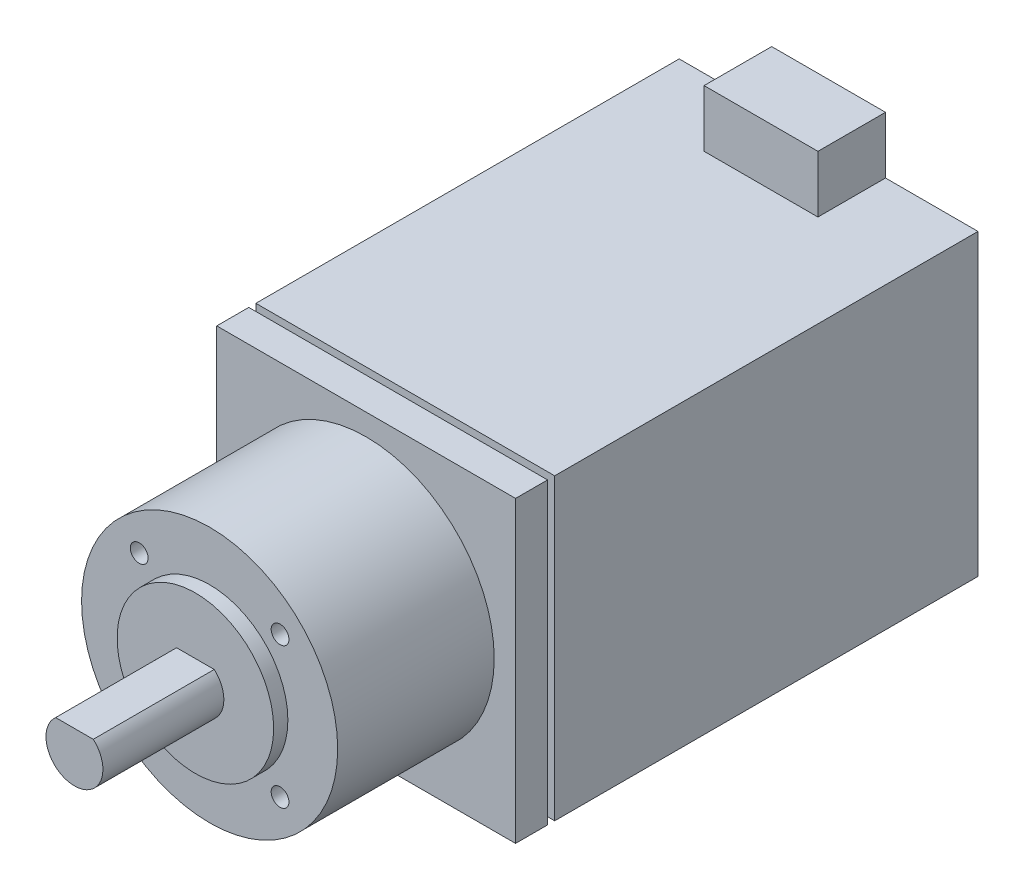
ISO-10303-21;
HEADER;
FILE_DESCRIPTION(('STEP AP214'),'2;1');
FILE_NAME('part.step','',(''),(''),'','','');
FILE_SCHEMA(('AUTOMOTIVE_DESIGN { 1 0 10303 214 1 1 1 1 }'));
ENDSEC;
DATA;
#1=APPLICATION_CONTEXT('core data for automotive mechanical design processes');
#2=APPLICATION_PROTOCOL_DEFINITION('international standard','automotive_design',2000,#1);
#3=PRODUCT_CONTEXT('',#1,'mechanical');
#4=PRODUCT('Part','Part','',(#3));
#5=PRODUCT_RELATED_PRODUCT_CATEGORY('part','',(#4));
#6=PRODUCT_DEFINITION_FORMATION('','',#4);
#7=PRODUCT_DEFINITION_CONTEXT('part definition',#1,'design');
#8=PRODUCT_DEFINITION('design','',#6,#7);
#9=PRODUCT_DEFINITION_SHAPE('','',#8);
#10=(LENGTH_UNIT() NAMED_UNIT(*) SI_UNIT(.MILLI.,.METRE.));
#11=(NAMED_UNIT(*) PLANE_ANGLE_UNIT() SI_UNIT($,.RADIAN.));
#12=(NAMED_UNIT(*) SI_UNIT($,.STERADIAN.) SOLID_ANGLE_UNIT());
#13=UNCERTAINTY_MEASURE_WITH_UNIT(LENGTH_MEASURE(1.E-05),#10,'distance_accuracy_value','');
#14=(GEOMETRIC_REPRESENTATION_CONTEXT(3) GLOBAL_UNCERTAINTY_ASSIGNED_CONTEXT((#13)) GLOBAL_UNIT_ASSIGNED_CONTEXT((#10,
#11,#12)) REPRESENTATION_CONTEXT('',''));
#15=CARTESIAN_POINT('',(0.,0.,0.));
#16=DIRECTION('',(0.,0.,1.));
#17=DIRECTION('',(1.,0.,0.));
#18=AXIS2_PLACEMENT_3D('',#15,#16,#17);
#19=CARTESIAN_POINT('',(-21.,21.,65.));
#20=DIRECTION('',(0.,-1.,0.));
#21=DIRECTION('',(0.,0.,-1.));
#22=AXIS2_PLACEMENT_3D('',#19,#20,#21);
#23=PLANE('',#22);
#24=DIRECTION('',(0.,0.,-1.));
#25=VECTOR('',#24,1.);
#26=CARTESIAN_POINT('',(8.,21.,9.5));
#27=LINE('',#26,#25);
#28=CARTESIAN_POINT('',(8.,21.,9.5));
#29=VERTEX_POINT('',#28);
#30=CARTESIAN_POINT('',(8.,21.,0.));
#31=VERTEX_POINT('',#30);
#32=EDGE_CURVE('E55',#29,#31,#27,.T.);
#33=ORIENTED_EDGE('',*,*,#32,.F.);
#34=DIRECTION('',(1.,0.,0.));
#35=VECTOR('',#34,1.);
#36=CARTESIAN_POINT('',(-8.,21.,9.5));
#37=LINE('',#36,#35);
#38=CARTESIAN_POINT('',(-8.,21.,9.5));
#39=VERTEX_POINT('',#38);
#40=EDGE_CURVE('E197',#39,#29,#37,.T.);
#41=ORIENTED_EDGE('',*,*,#40,.F.);
#42=DIRECTION('',(0.,0.,1.));
#43=VECTOR('',#42,1.);
#44=CARTESIAN_POINT('',(-8.,21.,9.5));
#45=LINE('',#44,#43);
#46=CARTESIAN_POINT('',(-8.,21.,0.));
#47=VERTEX_POINT('',#46);
#48=EDGE_CURVE('E61',#47,#39,#45,.T.);
#49=ORIENTED_EDGE('',*,*,#48,.F.);
#50=DIRECTION('',(-1.,0.,0.));
#51=VECTOR('',#50,1.);
#52=CARTESIAN_POINT('',(-21.,21.,0.));
#53=LINE('',#52,#51);
#54=CARTESIAN_POINT('',(-21.,21.,0.));
#55=VERTEX_POINT('',#54);
#56=EDGE_CURVE('E310',#47,#55,#53,.T.);
#57=ORIENTED_EDGE('',*,*,#56,.T.);
#58=DIRECTION('',(0.,0.,-1.));
#59=VECTOR('',#58,1.);
#60=CARTESIAN_POINT('',(-21.,21.,65.));
#61=LINE('',#60,#59);
#62=CARTESIAN_POINT('',(-21.,21.,59.5));
#63=VERTEX_POINT('',#62);
#64=EDGE_CURVE('E325',#63,#55,#61,.T.);
#65=ORIENTED_EDGE('',*,*,#64,.F.);
#66=DIRECTION('',(-1.,0.,0.));
#67=VECTOR('',#66,1.);
#68=CARTESIAN_POINT('',(-21.5,21.,59.5));
#69=LINE('',#68,#67);
#70=CARTESIAN_POINT('',(21.,21.,59.5));
#71=VERTEX_POINT('',#70);
#72=EDGE_CURVE('E253',#71,#63,#69,.T.);
#73=ORIENTED_EDGE('',*,*,#72,.F.);
#74=DIRECTION('',(0.,0.,-1.));
#75=VECTOR('',#74,1.);
#76=CARTESIAN_POINT('',(21.,21.,65.));
#77=LINE('',#76,#75);
#78=CARTESIAN_POINT('',(21.,21.,0.));
#79=VERTEX_POINT('',#78);
#80=EDGE_CURVE('E329',#71,#79,#77,.T.);
#81=ORIENTED_EDGE('',*,*,#80,.T.);
#82=EDGE_CURVE('E311',#79,#31,#53,.T.);
#83=ORIENTED_EDGE('',*,*,#82,.T.);
#84=EDGE_LOOP('',(#33,#41,#49,#57,#65,#73,#81,#83));
#85=FACE_BOUND('',#84,.T.);
#86=ADVANCED_FACE('F40',(#85),#23,.F.);
#87=CARTESIAN_POINT('',(21.,21.,65.));
#88=DIRECTION('',(-1.,0.,0.));
#89=DIRECTION('',(0.,-1.,0.));
#90=AXIS2_PLACEMENT_3D('',#87,#88,#89);
#91=PLANE('',#90);
#92=DIRECTION('',(0.,-1.,0.));
#93=VECTOR('',#92,1.);
#94=CARTESIAN_POINT('',(21.,21.,59.5));
#95=LINE('',#94,#93);
#96=CARTESIAN_POINT('',(20.9999999999999,-21.,59.5));
#97=VERTEX_POINT('',#96);
#98=EDGE_CURVE('E261',#71,#97,#95,.T.);
#99=ORIENTED_EDGE('',*,*,#98,.T.);
#100=DIRECTION('',(0.,0.,-1.));
#101=VECTOR('',#100,1.);
#102=CARTESIAN_POINT('',(21.,-21.,65.));
#103=LINE('',#102,#101);
#104=CARTESIAN_POINT('',(21.,-21.,0.));
#105=VERTEX_POINT('',#104);
#106=EDGE_CURVE('E307',#97,#105,#103,.T.);
#107=ORIENTED_EDGE('',*,*,#106,.T.);
#108=DIRECTION('',(0.,1.,0.));
#109=VECTOR('',#108,1.);
#110=CARTESIAN_POINT('',(21.,21.,0.));
#111=LINE('',#110,#109);
#112=EDGE_CURVE('E291',#105,#79,#111,.T.);
#113=ORIENTED_EDGE('',*,*,#112,.T.);
#114=ORIENTED_EDGE('',*,*,#80,.F.);
#115=EDGE_LOOP('',(#99,#107,#113,#114));
#116=FACE_BOUND('',#115,.T.);
#117=ADVANCED_FACE('F372',(#116),#91,.F.);
#118=CARTESIAN_POINT('',(-21.,21.,65.));
#119=DIRECTION('',(1.,0.,0.));
#120=DIRECTION('',(0.,1.,0.));
#121=AXIS2_PLACEMENT_3D('',#118,#119,#120);
#122=PLANE('',#121);
#123=DIRECTION('',(0.,0.,-1.));
#124=VECTOR('',#123,1.);
#125=CARTESIAN_POINT('',(-21.,-21.,65.));
#126=LINE('',#125,#124);
#127=CARTESIAN_POINT('',(-21.0000000000002,-21.,59.5));
#128=VERTEX_POINT('',#127);
#129=CARTESIAN_POINT('',(-21.,-21.,0.));
#130=VERTEX_POINT('',#129);
#131=EDGE_CURVE('E321',#128,#130,#126,.T.);
#132=ORIENTED_EDGE('',*,*,#131,.F.);
#133=DIRECTION('',(0.,1.,0.));
#134=VECTOR('',#133,1.);
#135=CARTESIAN_POINT('',(-21.,21.,59.5));
#136=LINE('',#135,#134);
#137=EDGE_CURVE('E334',#128,#63,#136,.T.);
#138=ORIENTED_EDGE('',*,*,#137,.T.);
#139=ORIENTED_EDGE('',*,*,#64,.T.);
#140=DIRECTION('',(0.,-1.,0.));
#141=VECTOR('',#140,1.);
#142=CARTESIAN_POINT('',(-21.,21.,0.));
#143=LINE('',#142,#141);
#144=EDGE_CURVE('E313',#55,#130,#143,.T.);
#145=ORIENTED_EDGE('',*,*,#144,.T.);
#146=EDGE_LOOP('',(#132,#138,#139,#145));
#147=FACE_BOUND('',#146,.T.);
#148=ADVANCED_FACE('F377',(#147),#122,.F.);
#149=CARTESIAN_POINT('',(-21.,-21.,65.));
#150=DIRECTION('',(0.,1.,0.));
#151=DIRECTION('',(0.,0.,1.));
#152=AXIS2_PLACEMENT_3D('',#149,#150,#151);
#153=PLANE('',#152);
#154=CARTESIAN_POINT('',(-21.,-21.,65.));
#155=VERTEX_POINT('',#154);
#156=CARTESIAN_POINT('',(-21.0000000000002,-21.,60.5));
#157=VERTEX_POINT('',#156);
#158=EDGE_CURVE('E322',#155,#157,#126,.T.);
#159=ORIENTED_EDGE('',*,*,#158,.T.);
#160=DIRECTION('',(1.,0.,0.));
#161=VECTOR('',#160,1.);
#162=CARTESIAN_POINT('',(-21.,-21.,60.5));
#163=LINE('',#162,#161);
#164=CARTESIAN_POINT('',(20.9999999999999,-21.,60.5));
#165=VERTEX_POINT('',#164);
#166=EDGE_CURVE('E250',#157,#165,#163,.T.);
#167=ORIENTED_EDGE('',*,*,#166,.T.);
#168=CARTESIAN_POINT('',(21.,-21.,65.));
#169=VERTEX_POINT('',#168);
#170=EDGE_CURVE('E318',#169,#165,#103,.T.);
#171=ORIENTED_EDGE('',*,*,#170,.F.);
#172=DIRECTION('',(1.,0.,0.));
#173=VECTOR('',#172,1.);
#174=CARTESIAN_POINT('',(-21.,-21.,65.));
#175=LINE('',#174,#173);
#176=EDGE_CURVE('E305',#155,#169,#175,.T.);
#177=ORIENTED_EDGE('',*,*,#176,.F.);
#178=EDGE_LOOP('',(#159,#167,#171,#177));
#179=FACE_BOUND('',#178,.T.);
#180=ADVANCED_FACE('F388',(#179),#153,.F.);
#181=CARTESIAN_POINT('',(0.,19.,0.));
#182=DIRECTION('',(0.,1.,0.));
#183=DIRECTION('',(0.,0.,1.));
#184=AXIS2_PLACEMENT_3D('',#181,#182,#183);
#185=PLANE('',#184);
#186=DIRECTION('',(1.,0.,0.));
#187=VECTOR('',#186,1.);
#188=CARTESIAN_POINT('',(-21.5,19.,60.5));
#189=LINE('',#188,#187);
#190=CARTESIAN_POINT('',(-18.9999999999998,19.,60.5));
#191=VERTEX_POINT('',#190);
#192=CARTESIAN_POINT('',(19.0000000000001,19.,60.5));
#193=VERTEX_POINT('',#192);
#194=EDGE_CURVE('E257',#191,#193,#189,.T.);
#195=ORIENTED_EDGE('',*,*,#194,.T.);
#196=DIRECTION('',(0.,0.,-1.));
#197=VECTOR('',#196,1.);
#198=CARTESIAN_POINT('',(19.0000000000001,19.,0.));
#199=LINE('',#198,#197);
#200=CARTESIAN_POINT('',(19.0000000000001,19.,59.5));
#201=VERTEX_POINT('',#200);
#202=EDGE_CURVE('E11',#193,#201,#199,.T.);
#203=ORIENTED_EDGE('',*,*,#202,.T.);
#204=DIRECTION('',(-1.,0.,0.));
#205=VECTOR('',#204,1.);
#206=CARTESIAN_POINT('',(-21.5,19.,59.5));
#207=LINE('',#206,#205);
#208=CARTESIAN_POINT('',(-18.9999999999998,19.,59.5));
#209=VERTEX_POINT('',#208);
#210=EDGE_CURVE('E254',#201,#209,#207,.T.);
#211=ORIENTED_EDGE('',*,*,#210,.T.);
#212=DIRECTION('',(0.,0.,1.));
#213=VECTOR('',#212,1.);
#214=CARTESIAN_POINT('',(-18.9999999999998,19.,0.));
#215=LINE('',#214,#213);
#216=EDGE_CURVE('E48',#209,#191,#215,.T.);
#217=ORIENTED_EDGE('',*,*,#216,.T.);
#218=EDGE_LOOP('',(#195,#203,#211,#217));
#219=FACE_BOUND('',#218,.T.);
#220=ADVANCED_FACE('F341',(#219),#185,.T.);
#221=CARTESIAN_POINT('',(21.,21.,65.));
#222=VERTEX_POINT('',#221);
#223=CARTESIAN_POINT('',(21.,21.,60.5));
#224=VERTEX_POINT('',#223);
#225=EDGE_CURVE('E296',#222,#224,#77,.T.);
#226=ORIENTED_EDGE('',*,*,#225,.T.);
#227=DIRECTION('',(1.,0.,0.));
#228=VECTOR('',#227,1.);
#229=CARTESIAN_POINT('',(-21.5,21.,60.5));
#230=LINE('',#229,#228);
#231=CARTESIAN_POINT('',(-21.,21.,60.5));
#232=VERTEX_POINT('',#231);
#233=EDGE_CURVE('E258',#232,#224,#230,.T.);
#234=ORIENTED_EDGE('',*,*,#233,.F.);
#235=CARTESIAN_POINT('',(-21.,21.,65.));
#236=VERTEX_POINT('',#235);
#237=EDGE_CURVE('E326',#236,#232,#61,.T.);
#238=ORIENTED_EDGE('',*,*,#237,.F.);
#239=DIRECTION('',(-1.,0.,0.));
#240=VECTOR('',#239,1.);
#241=CARTESIAN_POINT('',(-21.,21.,65.));
#242=LINE('',#241,#240);
#243=EDGE_CURVE('E300',#222,#236,#242,.T.);
#244=ORIENTED_EDGE('',*,*,#243,.F.);
#245=EDGE_LOOP('',(#226,#234,#238,#244));
#246=FACE_BOUND('',#245,.T.);
#247=ADVANCED_FACE('F373',(#246),#23,.F.);
#248=ORIENTED_EDGE('',*,*,#170,.T.);
#249=DIRECTION('',(0.,1.,0.));
#250=VECTOR('',#249,1.);
#251=CARTESIAN_POINT('',(21.,21.,60.5));
#252=LINE('',#251,#250);
#253=EDGE_CURVE('E265',#165,#224,#252,.T.);
#254=ORIENTED_EDGE('',*,*,#253,.T.);
#255=ORIENTED_EDGE('',*,*,#225,.F.);
#256=DIRECTION('',(0.,1.,0.));
#257=VECTOR('',#256,1.);
#258=CARTESIAN_POINT('',(21.,21.,65.));
#259=LINE('',#258,#257);
#260=EDGE_CURVE('E297',#169,#222,#259,.T.);
#261=ORIENTED_EDGE('',*,*,#260,.F.);
#262=EDGE_LOOP('',(#248,#254,#255,#261));
#263=FACE_BOUND('',#262,.T.);
#264=ADVANCED_FACE('F42',(#263),#91,.F.);
#265=DIRECTION('',(0.,-1.,0.));
#266=VECTOR('',#265,1.);
#267=CARTESIAN_POINT('',(-21.,21.,60.5));
#268=LINE('',#267,#266);
#269=EDGE_CURVE('E337',#232,#157,#268,.T.);
#270=ORIENTED_EDGE('',*,*,#269,.T.);
#271=ORIENTED_EDGE('',*,*,#158,.F.);
#272=DIRECTION('',(0.,-1.,0.));
#273=VECTOR('',#272,1.);
#274=CARTESIAN_POINT('',(-21.,21.,65.));
#275=LINE('',#274,#273);
#276=EDGE_CURVE('E303',#236,#155,#275,.T.);
#277=ORIENTED_EDGE('',*,*,#276,.F.);
#278=ORIENTED_EDGE('',*,*,#237,.T.);
#279=EDGE_LOOP('',(#270,#271,#277,#278));
#280=FACE_BOUND('',#279,.T.);
#281=ADVANCED_FACE('F386',(#280),#122,.F.);
#282=ORIENTED_EDGE('',*,*,#106,.F.);
#283=DIRECTION('',(-1.,0.,0.));
#284=VECTOR('',#283,1.);
#285=CARTESIAN_POINT('',(-21.,-21.,59.5));
#286=LINE('',#285,#284);
#287=EDGE_CURVE('E247',#97,#128,#286,.T.);
#288=ORIENTED_EDGE('',*,*,#287,.T.);
#289=ORIENTED_EDGE('',*,*,#131,.T.);
#290=DIRECTION('',(1.,0.,0.));
#291=VECTOR('',#290,1.);
#292=CARTESIAN_POINT('',(-21.,-21.,0.));
#293=LINE('',#292,#291);
#294=EDGE_CURVE('E301',#130,#105,#293,.T.);
#295=ORIENTED_EDGE('',*,*,#294,.T.);
#296=EDGE_LOOP('',(#282,#288,#289,#295));
#297=FACE_BOUND('',#296,.T.);
#298=ADVANCED_FACE('F405',(#297),#153,.F.);
#299=CARTESIAN_POINT('',(0.,0.,65.));
#300=DIRECTION('',(0.,0.,1.));
#301=DIRECTION('',(1.,0.,0.));
#302=AXIS2_PLACEMENT_3D('',#299,#300,#301);
#303=PLANE('',#302);
#304=CARTESIAN_POINT('',(0.,0.,65.));
#305=DIRECTION('',(0.,0.,1.));
#306=DIRECTION('',(1.,0.,0.));
#307=AXIS2_PLACEMENT_3D('',#304,#305,#306);
#308=CIRCLE('',#307,18.);
#309=CARTESIAN_POINT('',(18.,0.,65.));
#310=VERTEX_POINT('',#309);
#311=EDGE_CURVE('E292',#310,#310,#308,.T.);
#312=ORIENTED_EDGE('',*,*,#311,.F.);
#313=EDGE_LOOP('',(#312));
#314=FACE_BOUND('',#313,.T.);
#315=ORIENTED_EDGE('',*,*,#260,.T.);
#316=ORIENTED_EDGE('',*,*,#243,.T.);
#317=ORIENTED_EDGE('',*,*,#276,.T.);
#318=ORIENTED_EDGE('',*,*,#176,.T.);
#319=EDGE_LOOP('',(#315,#316,#317,#318));
#320=FACE_BOUND('',#319,.T.);
#321=ADVANCED_FACE('F403',(#314,#320),#303,.T.);
#322=CARTESIAN_POINT('',(0.,0.,0.));
#323=DIRECTION('',(0.,0.,1.));
#324=DIRECTION('',(1.,0.,0.));
#325=AXIS2_PLACEMENT_3D('',#322,#323,#324);
#326=PLANE('',#325);
#327=ORIENTED_EDGE('',*,*,#112,.F.);
#328=ORIENTED_EDGE('',*,*,#294,.F.);
#329=ORIENTED_EDGE('',*,*,#144,.F.);
#330=ORIENTED_EDGE('',*,*,#56,.F.);
#331=DIRECTION('',(0.,-1.,0.));
#332=VECTOR('',#331,1.);
#333=CARTESIAN_POINT('',(-8.,29.,0.));
#334=LINE('',#333,#332);
#335=CARTESIAN_POINT('',(-8.,29.,0.));
#336=VERTEX_POINT('',#335);
#337=EDGE_CURVE('E184',#336,#47,#334,.T.);
#338=ORIENTED_EDGE('',*,*,#337,.F.);
#339=DIRECTION('',(-1.,0.,0.));
#340=VECTOR('',#339,1.);
#341=CARTESIAN_POINT('',(-8.,29.,0.));
#342=LINE('',#341,#340);
#343=CARTESIAN_POINT('',(8.,29.,0.));
#344=VERTEX_POINT('',#343);
#345=EDGE_CURVE('E176',#344,#336,#342,.T.);
#346=ORIENTED_EDGE('',*,*,#345,.F.);
#347=DIRECTION('',(0.,-1.,0.));
#348=VECTOR('',#347,1.);
#349=CARTESIAN_POINT('',(8.,29.,0.));
#350=LINE('',#349,#348);
#351=EDGE_CURVE('E182',#344,#31,#350,.T.);
#352=ORIENTED_EDGE('',*,*,#351,.T.);
#353=ORIENTED_EDGE('',*,*,#82,.F.);
#354=EDGE_LOOP('',(#327,#328,#329,#330,#338,#346,#352,#353));
#355=FACE_BOUND('',#354,.T.);
#356=ADVANCED_FACE('F179',(#355),#326,.F.);
#357=CARTESIAN_POINT('',(0.,0.,87.));
#358=DIRECTION('',(0.,0.,-1.));
#359=DIRECTION('',(-1.,0.,0.));
#360=AXIS2_PLACEMENT_3D('',#357,#358,#359);
#361=CYLINDRICAL_SURFACE('',#360,18.);
#362=CARTESIAN_POINT('',(0.,0.,87.));
#363=DIRECTION('',(0.,0.,1.));
#364=DIRECTION('',(1.,0.,0.));
#365=AXIS2_PLACEMENT_3D('',#362,#363,#364);
#366=CIRCLE('',#365,18.);
#367=CARTESIAN_POINT('',(18.,0.,87.));
#368=VERTEX_POINT('',#367);
#369=EDGE_CURVE('E288',#368,#368,#366,.T.);
#370=ORIENTED_EDGE('',*,*,#369,.F.);
#371=EDGE_LOOP('',(#370));
#372=FACE_BOUND('',#371,.T.);
#373=ORIENTED_EDGE('',*,*,#311,.T.);
#374=EDGE_LOOP('',(#373));
#375=FACE_BOUND('',#374,.T.);
#376=ADVANCED_FACE('F412',(#372,#375),#361,.T.);
#377=CARTESIAN_POINT('',(0.,0.,87.));
#378=DIRECTION('',(0.,0.,1.));
#379=DIRECTION('',(1.,0.,0.));
#380=AXIS2_PLACEMENT_3D('',#377,#378,#379);
#381=PLANE('',#380);
#382=CARTESIAN_POINT('',(-9.89949493661165,9.89949493661168,87.));
#383=DIRECTION('',(0.,0.,1.));
#384=DIRECTION('',(1.,0.,0.));
#385=AXIS2_PLACEMENT_3D('',#382,#383,#384);
#386=CIRCLE('',#385,1.24999999999999);
#387=CARTESIAN_POINT('',(-8.64949493661166,9.89949493661168,87.));
#388=VERTEX_POINT('',#387);
#389=EDGE_CURVE('E200',#388,#388,#386,.T.);
#390=ORIENTED_EDGE('',*,*,#389,.F.);
#391=EDGE_LOOP('',(#390));
#392=FACE_BOUND('',#391,.T.);
#393=CARTESIAN_POINT('',(-9.89949493661168,-9.89949493661165,87.));
#394=DIRECTION('',(0.,0.,1.));
#395=DIRECTION('',(1.,0.,0.));
#396=AXIS2_PLACEMENT_3D('',#393,#394,#395);
#397=CIRCLE('',#396,1.24999999999999);
#398=CARTESIAN_POINT('',(-8.64949493661169,-9.89949493661165,87.));
#399=VERTEX_POINT('',#398);
#400=EDGE_CURVE('E211',#399,#399,#397,.T.);
#401=ORIENTED_EDGE('',*,*,#400,.F.);
#402=EDGE_LOOP('',(#401));
#403=FACE_BOUND('',#402,.T.);
#404=CARTESIAN_POINT('',(9.89949493661172,9.89949493661161,87.));
#405=DIRECTION('',(0.,0.,1.));
#406=DIRECTION('',(1.,0.,0.));
#407=AXIS2_PLACEMENT_3D('',#404,#405,#406);
#408=CIRCLE('',#407,1.24999999999999);
#409=CARTESIAN_POINT('',(11.1494949366117,9.89949493661161,87.));
#410=VERTEX_POINT('',#409);
#411=EDGE_CURVE('E217',#410,#410,#408,.T.);
#412=ORIENTED_EDGE('',*,*,#411,.F.);
#413=EDGE_LOOP('',(#412));
#414=FACE_BOUND('',#413,.T.);
#415=CARTESIAN_POINT('',(9.89949493661158,-9.89949493661175,87.));
#416=DIRECTION('',(0.,0.,1.));
#417=DIRECTION('',(1.,0.,0.));
#418=AXIS2_PLACEMENT_3D('',#415,#416,#417);
#419=CIRCLE('',#418,1.24999999999999);
#420=CARTESIAN_POINT('',(11.1494949366116,-9.89949493661175,87.));
#421=VERTEX_POINT('',#420);
#422=EDGE_CURVE('E223',#421,#421,#419,.T.);
#423=ORIENTED_EDGE('',*,*,#422,.F.);
#424=EDGE_LOOP('',(#423));
#425=FACE_BOUND('',#424,.T.);
#426=CARTESIAN_POINT('',(0.,0.,87.));
#427=DIRECTION('',(0.,0.,1.));
#428=DIRECTION('',(1.,0.,0.));
#429=AXIS2_PLACEMENT_3D('',#426,#427,#428);
#430=CIRCLE('',#429,11.);
#431=CARTESIAN_POINT('',(11.,0.,87.));
#432=VERTEX_POINT('',#431);
#433=EDGE_CURVE('E268',#432,#432,#430,.T.);
#434=ORIENTED_EDGE('',*,*,#433,.F.);
#435=EDGE_LOOP('',(#434));
#436=FACE_BOUND('',#435,.T.);
#437=ORIENTED_EDGE('',*,*,#369,.T.);
#438=EDGE_LOOP('',(#437));
#439=FACE_BOUND('',#438,.T.);
#440=ADVANCED_FACE('F497',(#392,#403,#414,#425,#436,#439),#381,.T.);
#441=CARTESIAN_POINT('',(0.,0.,89.));
#442=DIRECTION('',(0.,0.,1.));
#443=DIRECTION('',(1.,0.,0.));
#444=AXIS2_PLACEMENT_3D('',#441,#442,#443);
#445=PLANE('',#444);
#446=CARTESIAN_POINT('',(0.,0.,89.));
#447=DIRECTION('',(0.,0.,1.));
#448=DIRECTION('',(1.,0.,0.));
#449=AXIS2_PLACEMENT_3D('',#446,#447,#448);
#450=CIRCLE('',#449,11.);
#451=CARTESIAN_POINT('',(11.,0.,89.));
#452=VERTEX_POINT('',#451);
#453=EDGE_CURVE('E269',#452,#452,#450,.T.);
#454=ORIENTED_EDGE('',*,*,#453,.T.);
#455=EDGE_LOOP('',(#454));
#456=FACE_BOUND('',#455,.T.);
#457=CARTESIAN_POINT('',(0.,0.,89.));
#458=DIRECTION('',(0.,0.,1.));
#459=DIRECTION('',(1.,0.,0.));
#460=AXIS2_PLACEMENT_3D('',#457,#458,#459);
#461=CIRCLE('',#460,4.);
#462=CARTESIAN_POINT('',(-2.64575131106459,3.,89.));
#463=VERTEX_POINT('',#462);
#464=CARTESIAN_POINT('',(2.64575131106459,3.,89.));
#465=VERTEX_POINT('',#464);
#466=EDGE_CURVE('E272',#463,#465,#461,.T.);
#467=ORIENTED_EDGE('',*,*,#466,.F.);
#468=DIRECTION('',(-1.,0.,0.));
#469=VECTOR('',#468,1.);
#470=CARTESIAN_POINT('',(-2.64575131106459,3.,89.));
#471=LINE('',#470,#469);
#472=EDGE_CURVE('E295',#465,#463,#471,.T.);
#473=ORIENTED_EDGE('',*,*,#472,.F.);
#474=EDGE_LOOP('',(#467,#473));
#475=FACE_BOUND('',#474,.T.);
#476=ADVANCED_FACE('F500',(#456,#475),#445,.T.);
#477=CARTESIAN_POINT('',(0.,0.,89.));
#478=DIRECTION('',(0.,0.,-1.));
#479=DIRECTION('',(-1.,0.,0.));
#480=AXIS2_PLACEMENT_3D('',#477,#478,#479);
#481=CYLINDRICAL_SURFACE('',#480,11.);
#482=ORIENTED_EDGE('',*,*,#453,.F.);
#483=EDGE_LOOP('',(#482));
#484=FACE_BOUND('',#483,.T.);
#485=ORIENTED_EDGE('',*,*,#433,.T.);
#486=EDGE_LOOP('',(#485));
#487=FACE_BOUND('',#486,.T.);
#488=ADVANCED_FACE('F524',(#484,#487),#481,.T.);
#489=CARTESIAN_POINT('',(0.,0.,106.));
#490=DIRECTION('',(0.,0.,1.));
#491=DIRECTION('',(1.,0.,0.));
#492=AXIS2_PLACEMENT_3D('',#489,#490,#491);
#493=PLANE('',#492);
#494=CARTESIAN_POINT('',(0.,0.,106.));
#495=DIRECTION('',(0.,0.,1.));
#496=DIRECTION('',(1.,0.,0.));
#497=AXIS2_PLACEMENT_3D('',#494,#495,#496);
#498=CIRCLE('',#497,4.);
#499=CARTESIAN_POINT('',(-2.64575131106459,3.,106.));
#500=VERTEX_POINT('',#499);
#501=CARTESIAN_POINT('',(2.64575131106459,3.,106.));
#502=VERTEX_POINT('',#501);
#503=EDGE_CURVE('E277',#500,#502,#498,.T.);
#504=ORIENTED_EDGE('',*,*,#503,.T.);
#505=DIRECTION('',(-1.,0.,0.));
#506=VECTOR('',#505,1.);
#507=CARTESIAN_POINT('',(-2.64575131106459,3.,106.));
#508=LINE('',#507,#506);
#509=EDGE_CURVE('E280',#502,#500,#508,.T.);
#510=ORIENTED_EDGE('',*,*,#509,.T.);
#511=EDGE_LOOP('',(#504,#510));
#512=FACE_BOUND('',#511,.T.);
#513=ADVANCED_FACE('F532',(#512),#493,.T.);
#514=CARTESIAN_POINT('',(-2.64575131106459,3.,106.));
#515=DIRECTION('',(0.,-1.,0.));
#516=DIRECTION('',(0.,0.,-1.));
#517=AXIS2_PLACEMENT_3D('',#514,#515,#516);
#518=PLANE('',#517);
#519=DIRECTION('',(0.,0.,-1.));
#520=VECTOR('',#519,1.);
#521=CARTESIAN_POINT('',(2.64575131106459,3.,106.));
#522=LINE('',#521,#520);
#523=EDGE_CURVE('E285',#502,#465,#522,.T.);
#524=ORIENTED_EDGE('',*,*,#523,.T.);
#525=ORIENTED_EDGE('',*,*,#472,.T.);
#526=DIRECTION('',(0.,0.,-1.));
#527=VECTOR('',#526,1.);
#528=CARTESIAN_POINT('',(-2.64575131106459,3.,106.));
#529=LINE('',#528,#527);
#530=EDGE_CURVE('E282',#500,#463,#529,.T.);
#531=ORIENTED_EDGE('',*,*,#530,.F.);
#532=ORIENTED_EDGE('',*,*,#509,.F.);
#533=EDGE_LOOP('',(#524,#525,#531,#532));
#534=FACE_BOUND('',#533,.T.);
#535=ADVANCED_FACE('F540',(#534),#518,.F.);
#536=CARTESIAN_POINT('',(0.,0.,106.));
#537=DIRECTION('',(0.,0.,-1.));
#538=DIRECTION('',(-1.,0.,0.));
#539=AXIS2_PLACEMENT_3D('',#536,#537,#538);
#540=CYLINDRICAL_SURFACE('',#539,4.);
#541=ORIENTED_EDGE('',*,*,#530,.T.);
#542=ORIENTED_EDGE('',*,*,#466,.T.);
#543=ORIENTED_EDGE('',*,*,#523,.F.);
#544=ORIENTED_EDGE('',*,*,#503,.F.);
#545=EDGE_LOOP('',(#541,#542,#543,#544));
#546=FACE_BOUND('',#545,.T.);
#547=ADVANCED_FACE('F547',(#546),#540,.T.);
#548=CARTESIAN_POINT('',(-21.5,19.,60.5));
#549=DIRECTION('',(0.,0.,1.));
#550=DIRECTION('',(1.,0.,0.));
#551=AXIS2_PLACEMENT_3D('',#548,#549,#550);
#552=PLANE('',#551);
#553=ORIENTED_EDGE('',*,*,#233,.T.);
#554=ORIENTED_EDGE('',*,*,#253,.F.);
#555=ORIENTED_EDGE('',*,*,#166,.F.);
#556=ORIENTED_EDGE('',*,*,#269,.F.);
#557=EDGE_LOOP('',(#553,#554,#555,#556));
#558=FACE_BOUND('',#557,.T.);
#559=DIRECTION('',(0.,-1.,0.));
#560=VECTOR('',#559,1.);
#561=CARTESIAN_POINT('',(19.0000000000001,21.5,60.5));
#562=LINE('',#561,#560);
#563=CARTESIAN_POINT('',(19.,-19.,60.5));
#564=VERTEX_POINT('',#563);
#565=EDGE_CURVE('E245',#193,#564,#562,.T.);
#566=ORIENTED_EDGE('',*,*,#565,.F.);
#567=ORIENTED_EDGE('',*,*,#194,.F.);
#568=DIRECTION('',(0.,1.,0.));
#569=VECTOR('',#568,1.);
#570=CARTESIAN_POINT('',(-19.0000000000002,-21.4999999999998,60.5));
#571=LINE('',#570,#569);
#572=CARTESIAN_POINT('',(-19.0000000000002,-19.,60.5));
#573=VERTEX_POINT('',#572);
#574=EDGE_CURVE('E231',#573,#191,#571,.T.);
#575=ORIENTED_EDGE('',*,*,#574,.F.);
#576=DIRECTION('',(-1.,0.,0.));
#577=VECTOR('',#576,1.);
#578=CARTESIAN_POINT('',(21.5,-19.,60.5));
#579=LINE('',#578,#577);
#580=EDGE_CURVE('E238',#564,#573,#579,.T.);
#581=ORIENTED_EDGE('',*,*,#580,.F.);
#582=EDGE_LOOP('',(#566,#567,#575,#581));
#583=FACE_BOUND('',#582,.T.);
#584=ADVANCED_FACE('F348',(#558,#583),#552,.F.);
#585=CARTESIAN_POINT('',(-21.5,19.,59.5));
#586=DIRECTION('',(0.,0.,-1.));
#587=DIRECTION('',(-1.,0.,0.));
#588=AXIS2_PLACEMENT_3D('',#585,#586,#587);
#589=PLANE('',#588);
#590=ORIENTED_EDGE('',*,*,#210,.F.);
#591=DIRECTION('',(0.,1.,0.));
#592=VECTOR('',#591,1.);
#593=CARTESIAN_POINT('',(19.0000000000001,21.5,59.5));
#594=LINE('',#593,#592);
#595=CARTESIAN_POINT('',(18.9999999999999,-19.,59.5));
#596=VERTEX_POINT('',#595);
#597=EDGE_CURVE('E243',#596,#201,#594,.T.);
#598=ORIENTED_EDGE('',*,*,#597,.F.);
#599=DIRECTION('',(1.,0.,0.));
#600=VECTOR('',#599,1.);
#601=CARTESIAN_POINT('',(21.5,-19.,59.5));
#602=LINE('',#601,#600);
#603=CARTESIAN_POINT('',(-19.0000000000002,-19.,59.5));
#604=VERTEX_POINT('',#603);
#605=EDGE_CURVE('E236',#604,#596,#602,.T.);
#606=ORIENTED_EDGE('',*,*,#605,.F.);
#607=DIRECTION('',(0.,-1.,0.));
#608=VECTOR('',#607,1.);
#609=CARTESIAN_POINT('',(-19.0000000000002,-21.4999999999998,59.5));
#610=LINE('',#609,#608);
#611=EDGE_CURVE('E229',#209,#604,#610,.T.);
#612=ORIENTED_EDGE('',*,*,#611,.F.);
#613=EDGE_LOOP('',(#590,#598,#606,#612));
#614=FACE_BOUND('',#613,.T.);
#615=ORIENTED_EDGE('',*,*,#137,.F.);
#616=ORIENTED_EDGE('',*,*,#287,.F.);
#617=ORIENTED_EDGE('',*,*,#98,.F.);
#618=ORIENTED_EDGE('',*,*,#72,.T.);
#619=EDGE_LOOP('',(#615,#616,#617,#618));
#620=FACE_BOUND('',#619,.T.);
#621=ADVANCED_FACE('F356',(#614,#620),#589,.F.);
#622=CARTESIAN_POINT('',(19.,0.,0.));
#623=DIRECTION('',(1.,0.,0.));
#624=DIRECTION('',(0.,0.,1.));
#625=AXIS2_PLACEMENT_3D('',#622,#623,#624);
#626=PLANE('',#625);
#627=ORIENTED_EDGE('',*,*,#565,.T.);
#628=DIRECTION('',(0.,0.,-1.));
#629=VECTOR('',#628,1.);
#630=CARTESIAN_POINT('',(18.9999999999999,-19.,0.));
#631=LINE('',#630,#629);
#632=EDGE_CURVE('E240',#564,#596,#631,.T.);
#633=ORIENTED_EDGE('',*,*,#632,.T.);
#634=ORIENTED_EDGE('',*,*,#597,.T.);
#635=ORIENTED_EDGE('',*,*,#202,.F.);
#636=EDGE_LOOP('',(#627,#633,#634,#635));
#637=FACE_BOUND('',#636,.T.);
#638=ADVANCED_FACE('F353',(#637),#626,.T.);
#639=CARTESIAN_POINT('',(0.,-19.,0.));
#640=DIRECTION('',(0.,-1.,0.));
#641=DIRECTION('',(0.,0.,1.));
#642=AXIS2_PLACEMENT_3D('',#639,#640,#641);
#643=PLANE('',#642);
#644=ORIENTED_EDGE('',*,*,#580,.T.);
#645=DIRECTION('',(0.,0.,-1.));
#646=VECTOR('',#645,1.);
#647=CARTESIAN_POINT('',(-19.0000000000002,-19.,0.));
#648=LINE('',#647,#646);
#649=EDGE_CURVE('E233',#573,#604,#648,.T.);
#650=ORIENTED_EDGE('',*,*,#649,.T.);
#651=ORIENTED_EDGE('',*,*,#605,.T.);
#652=ORIENTED_EDGE('',*,*,#632,.F.);
#653=EDGE_LOOP('',(#644,#650,#651,#652));
#654=FACE_BOUND('',#653,.T.);
#655=ADVANCED_FACE('F361',(#654),#643,.T.);
#656=CARTESIAN_POINT('',(-19.,1.99014436314059E-13,0.));
#657=DIRECTION('',(-1.,0.,0.));
#658=DIRECTION('',(0.,0.,1.));
#659=AXIS2_PLACEMENT_3D('',#656,#657,#658);
#660=PLANE('',#659);
#661=ORIENTED_EDGE('',*,*,#611,.T.);
#662=ORIENTED_EDGE('',*,*,#649,.F.);
#663=ORIENTED_EDGE('',*,*,#574,.T.);
#664=ORIENTED_EDGE('',*,*,#216,.F.);
#665=EDGE_LOOP('',(#661,#662,#663,#664));
#666=FACE_BOUND('',#665,.T.);
#667=ADVANCED_FACE('F359',(#666),#660,.T.);
#668=CARTESIAN_POINT('',(9.89949493661158,-9.89949493661175,79.5));
#669=DIRECTION('',(0.,0.,1.));
#670=DIRECTION('',(1.,0.,0.));
#671=AXIS2_PLACEMENT_3D('',#668,#669,#670);
#672=CONICAL_SURFACE('',#671,1.24999999999999,1.02974425867665);
#673=CARTESIAN_POINT('',(9.89949493661158,-9.89949493661175,78.7489242262155));
#674=VERTEX_POINT('',#673);
#675=VERTEX_LOOP('',#674);
#676=FACE_BOUND('',#675,.T.);
#677=CARTESIAN_POINT('',(9.89949493661158,-9.89949493661175,79.5));
#678=DIRECTION('',(0.,0.,1.));
#679=DIRECTION('',(1.,0.,0.));
#680=AXIS2_PLACEMENT_3D('',#677,#678,#679);
#681=CIRCLE('',#680,1.24999999999999);
#682=CARTESIAN_POINT('',(11.1494949366116,-9.89949493661175,79.5));
#683=VERTEX_POINT('',#682);
#684=EDGE_CURVE('E226',#683,#683,#681,.T.);
#685=ORIENTED_EDGE('',*,*,#684,.T.);
#686=EDGE_LOOP('',(#685));
#687=FACE_BOUND('',#686,.T.);
#688=ADVANCED_FACE('F368',(#676,#687),#672,.F.);
#689=CARTESIAN_POINT('',(9.89949493661158,-9.89949493661175,87.));
#690=DIRECTION('',(0.,0.,1.));
#691=DIRECTION('',(1.,0.,0.));
#692=AXIS2_PLACEMENT_3D('',#689,#690,#691);
#693=CYLINDRICAL_SURFACE('',#692,1.24999999999999);
#694=ORIENTED_EDGE('',*,*,#684,.F.);
#695=EDGE_LOOP('',(#694));
#696=FACE_BOUND('',#695,.T.);
#697=ORIENTED_EDGE('',*,*,#422,.T.);
#698=EDGE_LOOP('',(#697));
#699=FACE_BOUND('',#698,.T.);
#700=ADVANCED_FACE('F483',(#696,#699),#693,.F.);
#701=CARTESIAN_POINT('',(9.89949493661172,9.89949493661161,79.5));
#702=DIRECTION('',(0.,0.,1.));
#703=DIRECTION('',(1.,0.,0.));
#704=AXIS2_PLACEMENT_3D('',#701,#702,#703);
#705=CONICAL_SURFACE('',#704,1.24999999999999,1.02974425867665);
#706=CARTESIAN_POINT('',(9.89949493661172,9.89949493661161,78.7489242262155));
#707=VERTEX_POINT('',#706);
#708=VERTEX_LOOP('',#707);
#709=FACE_BOUND('',#708,.T.);
#710=CARTESIAN_POINT('',(9.89949493661172,9.89949493661161,79.5));
#711=DIRECTION('',(0.,0.,1.));
#712=DIRECTION('',(1.,0.,0.));
#713=AXIS2_PLACEMENT_3D('',#710,#711,#712);
#714=CIRCLE('',#713,1.24999999999999);
#715=CARTESIAN_POINT('',(11.1494949366117,9.89949493661161,79.5));
#716=VERTEX_POINT('',#715);
#717=EDGE_CURVE('E220',#716,#716,#714,.T.);
#718=ORIENTED_EDGE('',*,*,#717,.T.);
#719=EDGE_LOOP('',(#718));
#720=FACE_BOUND('',#719,.T.);
#721=ADVANCED_FACE('F479',(#709,#720),#705,.F.);
#722=CARTESIAN_POINT('',(9.89949493661172,9.89949493661161,87.));
#723=DIRECTION('',(0.,0.,1.));
#724=DIRECTION('',(1.,0.,0.));
#725=AXIS2_PLACEMENT_3D('',#722,#723,#724);
#726=CYLINDRICAL_SURFACE('',#725,1.24999999999999);
#727=ORIENTED_EDGE('',*,*,#717,.F.);
#728=EDGE_LOOP('',(#727));
#729=FACE_BOUND('',#728,.T.);
#730=ORIENTED_EDGE('',*,*,#411,.T.);
#731=EDGE_LOOP('',(#730));
#732=FACE_BOUND('',#731,.T.);
#733=ADVANCED_FACE('F475',(#729,#732),#726,.F.);
#734=CARTESIAN_POINT('',(-9.89949493661168,-9.89949493661165,79.5));
#735=DIRECTION('',(0.,0.,1.));
#736=DIRECTION('',(1.,0.,0.));
#737=AXIS2_PLACEMENT_3D('',#734,#735,#736);
#738=CONICAL_SURFACE('',#737,1.24999999999999,1.02974425867665);
#739=CARTESIAN_POINT('',(-9.89949493661168,-9.89949493661165,78.7489242262155));
#740=VERTEX_POINT('',#739);
#741=VERTEX_LOOP('',#740);
#742=FACE_BOUND('',#741,.T.);
#743=CARTESIAN_POINT('',(-9.89949493661168,-9.89949493661165,79.5));
#744=DIRECTION('',(0.,0.,1.));
#745=DIRECTION('',(1.,0.,0.));
#746=AXIS2_PLACEMENT_3D('',#743,#744,#745);
#747=CIRCLE('',#746,1.24999999999999);
#748=CARTESIAN_POINT('',(-8.64949493661169,-9.89949493661165,79.5));
#749=VERTEX_POINT('',#748);
#750=EDGE_CURVE('E214',#749,#749,#747,.T.);
#751=ORIENTED_EDGE('',*,*,#750,.T.);
#752=EDGE_LOOP('',(#751));
#753=FACE_BOUND('',#752,.T.);
#754=ADVANCED_FACE('F471',(#742,#753),#738,.F.);
#755=CARTESIAN_POINT('',(-9.89949493661168,-9.89949493661165,87.));
#756=DIRECTION('',(0.,0.,1.));
#757=DIRECTION('',(1.,0.,0.));
#758=AXIS2_PLACEMENT_3D('',#755,#756,#757);
#759=CYLINDRICAL_SURFACE('',#758,1.24999999999999);
#760=ORIENTED_EDGE('',*,*,#750,.F.);
#761=EDGE_LOOP('',(#760));
#762=FACE_BOUND('',#761,.T.);
#763=ORIENTED_EDGE('',*,*,#400,.T.);
#764=EDGE_LOOP('',(#763));
#765=FACE_BOUND('',#764,.T.);
#766=ADVANCED_FACE('F467',(#762,#765),#759,.F.);
#767=CARTESIAN_POINT('',(-9.89949493661165,9.89949493661168,79.5));
#768=DIRECTION('',(0.,0.,1.));
#769=DIRECTION('',(1.,0.,0.));
#770=AXIS2_PLACEMENT_3D('',#767,#768,#769);
#771=CONICAL_SURFACE('',#770,1.24999999999999,1.02974425867665);
#772=CARTESIAN_POINT('',(-9.89949493661165,9.89949493661168,78.7489242262155));
#773=VERTEX_POINT('',#772);
#774=VERTEX_LOOP('',#773);
#775=FACE_BOUND('',#774,.T.);
#776=CARTESIAN_POINT('',(-9.89949493661165,9.89949493661168,79.5));
#777=DIRECTION('',(0.,0.,1.));
#778=DIRECTION('',(1.,0.,0.));
#779=AXIS2_PLACEMENT_3D('',#776,#777,#778);
#780=CIRCLE('',#779,1.24999999999999);
#781=CARTESIAN_POINT('',(-8.64949493661166,9.89949493661168,79.5));
#782=VERTEX_POINT('',#781);
#783=EDGE_CURVE('E203',#782,#782,#780,.T.);
#784=ORIENTED_EDGE('',*,*,#783,.T.);
#785=EDGE_LOOP('',(#784));
#786=FACE_BOUND('',#785,.T.);
#787=ADVANCED_FACE('F463',(#775,#786),#771,.F.);
#788=CARTESIAN_POINT('',(-9.89949493661165,9.89949493661168,87.));
#789=DIRECTION('',(0.,0.,1.));
#790=DIRECTION('',(1.,0.,0.));
#791=AXIS2_PLACEMENT_3D('',#788,#789,#790);
#792=CYLINDRICAL_SURFACE('',#791,1.24999999999999);
#793=ORIENTED_EDGE('',*,*,#783,.F.);
#794=EDGE_LOOP('',(#793));
#795=FACE_BOUND('',#794,.T.);
#796=ORIENTED_EDGE('',*,*,#389,.T.);
#797=EDGE_LOOP('',(#796));
#798=FACE_BOUND('',#797,.T.);
#799=ADVANCED_FACE('F460',(#795,#798),#792,.F.);
#800=CARTESIAN_POINT('',(8.,29.,9.5));
#801=DIRECTION('',(-1.,0.,0.));
#802=DIRECTION('',(0.,0.,1.));
#803=AXIS2_PLACEMENT_3D('',#800,#801,#802);
#804=PLANE('',#803);
#805=ORIENTED_EDGE('',*,*,#32,.T.);
#806=ORIENTED_EDGE('',*,*,#351,.F.);
#807=DIRECTION('',(0.,0.,-1.));
#808=VECTOR('',#807,1.);
#809=CARTESIAN_POINT('',(8.,29.,9.5));
#810=LINE('',#809,#808);
#811=CARTESIAN_POINT('',(8.,29.,9.5));
#812=VERTEX_POINT('',#811);
#813=EDGE_CURVE('E188',#812,#344,#810,.T.);
#814=ORIENTED_EDGE('',*,*,#813,.F.);
#815=DIRECTION('',(0.,-1.,0.));
#816=VECTOR('',#815,1.);
#817=CARTESIAN_POINT('',(8.,29.,9.5));
#818=LINE('',#817,#816);
#819=EDGE_CURVE('E441',#812,#29,#818,.T.);
#820=ORIENTED_EDGE('',*,*,#819,.T.);
#821=EDGE_LOOP('',(#805,#806,#814,#820));
#822=FACE_BOUND('',#821,.T.);
#823=ADVANCED_FACE('F199',(#822),#804,.F.);
#824=CARTESIAN_POINT('',(-8.,29.,9.5));
#825=DIRECTION('',(1.,0.,0.));
#826=DIRECTION('',(0.,0.,-1.));
#827=AXIS2_PLACEMENT_3D('',#824,#825,#826);
#828=PLANE('',#827);
#829=ORIENTED_EDGE('',*,*,#48,.T.);
#830=DIRECTION('',(0.,-1.,0.));
#831=VECTOR('',#830,1.);
#832=CARTESIAN_POINT('',(-8.,29.,9.5));
#833=LINE('',#832,#831);
#834=CARTESIAN_POINT('',(-8.,29.,9.5));
#835=VERTEX_POINT('',#834);
#836=EDGE_CURVE('E205',#835,#39,#833,.T.);
#837=ORIENTED_EDGE('',*,*,#836,.F.);
#838=DIRECTION('',(0.,0.,1.));
#839=VECTOR('',#838,1.);
#840=CARTESIAN_POINT('',(-8.,29.,9.5));
#841=LINE('',#840,#839);
#842=EDGE_CURVE('E187',#336,#835,#841,.T.);
#843=ORIENTED_EDGE('',*,*,#842,.F.);
#844=ORIENTED_EDGE('',*,*,#337,.T.);
#845=EDGE_LOOP('',(#829,#837,#843,#844));
#846=FACE_BOUND('',#845,.T.);
#847=ADVANCED_FACE('F437',(#846),#828,.F.);
#848=CARTESIAN_POINT('',(-8.,29.,9.5));
#849=DIRECTION('',(0.,0.,-1.));
#850=DIRECTION('',(-1.,0.,0.));
#851=AXIS2_PLACEMENT_3D('',#848,#849,#850);
#852=PLANE('',#851);
#853=ORIENTED_EDGE('',*,*,#40,.T.);
#854=ORIENTED_EDGE('',*,*,#819,.F.);
#855=DIRECTION('',(1.,0.,0.));
#856=VECTOR('',#855,1.);
#857=CARTESIAN_POINT('',(-8.,29.,9.5));
#858=LINE('',#857,#856);
#859=EDGE_CURVE('E193',#835,#812,#858,.T.);
#860=ORIENTED_EDGE('',*,*,#859,.F.);
#861=ORIENTED_EDGE('',*,*,#836,.T.);
#862=EDGE_LOOP('',(#853,#854,#860,#861));
#863=FACE_BOUND('',#862,.T.);
#864=ADVANCED_FACE('F448',(#863),#852,.F.);
#865=CARTESIAN_POINT('',(0.,29.,0.));
#866=DIRECTION('',(0.,-1.,0.));
#867=DIRECTION('',(0.,0.,-1.));
#868=AXIS2_PLACEMENT_3D('',#865,#866,#867);
#869=PLANE('',#868);
#870=ORIENTED_EDGE('',*,*,#813,.T.);
#871=ORIENTED_EDGE('',*,*,#345,.T.);
#872=ORIENTED_EDGE('',*,*,#842,.T.);
#873=ORIENTED_EDGE('',*,*,#859,.T.);
#874=EDGE_LOOP('',(#870,#871,#872,#873));
#875=FACE_BOUND('',#874,.T.);
#876=ADVANCED_FACE('F191',(#875),#869,.F.);
#877=CLOSED_SHELL('',(#86,#117,#148,#180,#220,#247,#264,#281,#298,#321,#356,#376,#440,#476,#488,
#513,#535,#547,#584,#621,#638,#655,#667,#688,#700,#721,#733,#754,#766,#787,#799,#823,#847,#864,#876));
#878=MANIFOLD_SOLID_BREP('B2',#877);
#879=ADVANCED_BREP_SHAPE_REPRESENTATION('',(#18,#878),#14);
#880=SHAPE_DEFINITION_REPRESENTATION(#9,#879);
ENDSEC;
END-ISO-10303-21;
